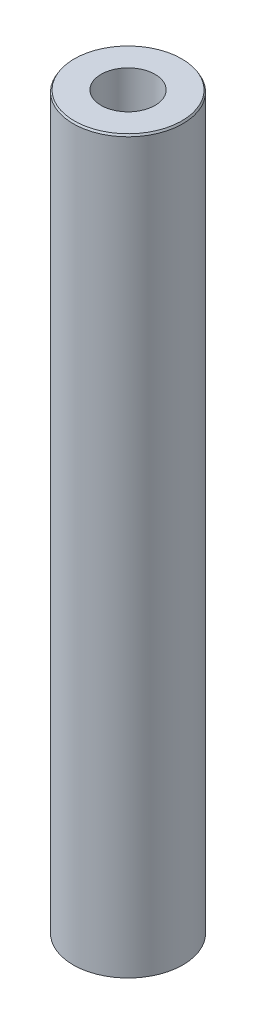
ISO-10303-21;
HEADER;
FILE_DESCRIPTION(('STEP AP214'),'2;1');
FILE_NAME('part.step','',(''),(''),'','','');
FILE_SCHEMA(('AUTOMOTIVE_DESIGN { 1 0 10303 214 1 1 1 1 }'));
ENDSEC;
DATA;
#1=APPLICATION_CONTEXT('core data for automotive mechanical design processes');
#2=APPLICATION_PROTOCOL_DEFINITION('international standard','automotive_design',2000,#1);
#3=PRODUCT_CONTEXT('',#1,'mechanical');
#4=PRODUCT('Part','Part','',(#3));
#5=PRODUCT_RELATED_PRODUCT_CATEGORY('part','',(#4));
#6=PRODUCT_DEFINITION_FORMATION('','',#4);
#7=PRODUCT_DEFINITION_CONTEXT('part definition',#1,'design');
#8=PRODUCT_DEFINITION('design','',#6,#7);
#9=PRODUCT_DEFINITION_SHAPE('','',#8);
#10=(LENGTH_UNIT() NAMED_UNIT(*) SI_UNIT(.MILLI.,.METRE.));
#11=(NAMED_UNIT(*) PLANE_ANGLE_UNIT() SI_UNIT($,.RADIAN.));
#12=(NAMED_UNIT(*) SI_UNIT($,.STERADIAN.) SOLID_ANGLE_UNIT());
#13=UNCERTAINTY_MEASURE_WITH_UNIT(LENGTH_MEASURE(1.E-05),#10,'distance_accuracy_value','');
#14=(GEOMETRIC_REPRESENTATION_CONTEXT(3) GLOBAL_UNCERTAINTY_ASSIGNED_CONTEXT((#13)) GLOBAL_UNIT_ASSIGNED_CONTEXT((#10,
#11,#12)) REPRESENTATION_CONTEXT('',''));
#15=CARTESIAN_POINT('',(0.,0.,0.));
#16=DIRECTION('',(0.,0.,1.));
#17=DIRECTION('',(1.,0.,0.));
#18=AXIS2_PLACEMENT_3D('',#15,#16,#17);
#19=CARTESIAN_POINT('',(0.,600.,0.));
#20=DIRECTION('',(0.,-1.,0.));
#21=DIRECTION('',(0.,0.,-1.));
#22=AXIS2_PLACEMENT_3D('',#19,#20,#21);
#23=CYLINDRICAL_SURFACE('',#22,45.);
#24=CARTESIAN_POINT('',(0.,598.449979658059,0.));
#25=DIRECTION('',(0.,1.,0.));
#26=DIRECTION('',(0.,0.,1.));
#27=AXIS2_PLACEMENT_3D('',#24,#25,#26);
#28=CIRCLE('',#27,45.);
#29=CARTESIAN_POINT('',(0.,598.449979658059,-45.));
#30=VERTEX_POINT('',#29);
#31=EDGE_CURVE('E50',#30,#30,#28,.F.);
#32=CARTESIAN_POINT('',(0.,0.894904661668861,0.));
#33=DIRECTION('',(0.,1.,0.));
#34=DIRECTION('',(0.,0.,1.));
#35=AXIS2_PLACEMENT_3D('',#32,#33,#34);
#36=CIRCLE('',#35,45.);
#37=CARTESIAN_POINT('',(0.,0.894904661668749,-45.));
#38=VERTEX_POINT('',#37);
#39=EDGE_CURVE('E51',#38,#38,#36,.T.);
#40=CARTESIAN_POINT('',(0.,598.449979658059,-45.));
#41=CARTESIAN_POINT('',(0.,592.225447626847,-45.));
#42=CARTESIAN_POINT('',(0.,586.000915595634,-45.));
#43=CARTESIAN_POINT('',(0.,573.551851533209,-45.));
#44=CARTESIAN_POINT('',(0.,567.327319501997,-45.));
#45=CARTESIAN_POINT('',(0.,554.878255439572,-45.));
#46=CARTESIAN_POINT('',(0.,548.65372340836,-45.));
#47=CARTESIAN_POINT('',(0.,536.204659345935,-45.));
#48=CARTESIAN_POINT('',(0.,529.980127314723,-45.));
#49=CARTESIAN_POINT('',(0.,517.531063252298,-45.));
#50=CARTESIAN_POINT('',(0.,511.306531221085,-45.));
#51=CARTESIAN_POINT('',(0.,498.857467158661,-45.));
#52=CARTESIAN_POINT('',(0.,492.632935127448,-45.));
#53=CARTESIAN_POINT('',(0.,480.183871065023,-45.));
#54=CARTESIAN_POINT('',(0.,473.959339033811,-45.));
#55=CARTESIAN_POINT('',(0.,461.510274971386,-45.));
#56=CARTESIAN_POINT('',(0.,455.285742940174,-45.));
#57=CARTESIAN_POINT('',(0.,442.836678877749,-45.));
#58=CARTESIAN_POINT('',(0.,436.612146846537,-45.));
#59=CARTESIAN_POINT('',(0.,424.163082784112,-45.));
#60=CARTESIAN_POINT('',(0.,417.938550752899,-45.));
#61=CARTESIAN_POINT('',(0.,405.489486690475,-45.));
#62=CARTESIAN_POINT('',(0.,399.264954659262,-45.));
#63=CARTESIAN_POINT('',(0.,386.815890596837,-45.));
#64=CARTESIAN_POINT('',(0.,380.591358565625,-45.));
#65=CARTESIAN_POINT('',(0.,368.1422945032,-45.));
#66=CARTESIAN_POINT('',(0.,361.917762471988,-45.));
#67=CARTESIAN_POINT('',(0.,349.468698409563,-45.));
#68=CARTESIAN_POINT('',(0.,343.244166378351,-45.));
#69=CARTESIAN_POINT('',(0.,330.795102315926,-45.));
#70=CARTESIAN_POINT('',(0.,324.570570284713,-45.));
#71=CARTESIAN_POINT('',(0.,312.121506222289,-45.));
#72=CARTESIAN_POINT('',(0.,305.896974191076,-45.));
#73=CARTESIAN_POINT('',(0.,293.447910128651,-45.));
#74=CARTESIAN_POINT('',(0.,287.223378097439,-45.));
#75=CARTESIAN_POINT('',(0.,274.774314035014,-45.));
#76=CARTESIAN_POINT('',(0.,268.549782003802,-45.));
#77=CARTESIAN_POINT('',(0.,256.100717941377,-45.));
#78=CARTESIAN_POINT('',(0.,249.876185910165,-45.));
#79=CARTESIAN_POINT('',(0.,237.42712184774,-45.));
#80=CARTESIAN_POINT('',(0.,231.202589816527,-45.));
#81=CARTESIAN_POINT('',(0.,218.753525754103,-45.));
#82=CARTESIAN_POINT('',(0.,212.52899372289,-45.));
#83=CARTESIAN_POINT('',(0.,200.079929660465,-45.));
#84=CARTESIAN_POINT('',(0.,193.855397629253,-45.));
#85=CARTESIAN_POINT('',(0.,181.406333566828,-45.));
#86=CARTESIAN_POINT('',(0.,175.181801535616,-45.));
#87=CARTESIAN_POINT('',(0.,162.732737473191,-45.));
#88=CARTESIAN_POINT('',(0.,156.508205441979,-45.));
#89=CARTESIAN_POINT('',(0.,144.059141379554,-45.));
#90=CARTESIAN_POINT('',(0.,137.834609348342,-45.));
#91=CARTESIAN_POINT('',(0.,125.385545285917,-45.));
#92=CARTESIAN_POINT('',(0.,119.161013254704,-45.));
#93=CARTESIAN_POINT('',(0.,106.711949192279,-45.));
#94=CARTESIAN_POINT('',(0.,100.487417161067,-45.));
#95=CARTESIAN_POINT('',(0.,88.0383530986423,-45.));
#96=CARTESIAN_POINT('',(0.,81.8138210674298,-45.));
#97=CARTESIAN_POINT('',(0.,69.3647570050051,-45.));
#98=CARTESIAN_POINT('',(0.,63.1402249737927,-45.));
#99=CARTESIAN_POINT('',(0.,50.6911609113679,-45.));
#100=CARTESIAN_POINT('',(0.,44.4666288801555,-45.));
#101=CARTESIAN_POINT('',(0.,32.0175648177307,-45.));
#102=CARTESIAN_POINT('',(0.,25.7930327865182,-45.));
#103=CARTESIAN_POINT('',(0.,13.3439687240935,-45.));
#104=CARTESIAN_POINT('',(0.,7.1194366928811,-45.));
#105=CARTESIAN_POINT('',(0.,0.894904661668749,-45.));
#106=B_SPLINE_CURVE_WITH_KNOTS('',3,(#40,#41,#42,#43,#44,#45,#46,#47,#48,#49,#50,#51,#52,#53,
#54,#55,#56,#57,#58,#59,#60,#61,#62,#63,#64,#65,#66,#67,#68,#69,#70,#71,#72,#73,#74,#75,#76,#77,
#78,#79,#80,#81,#82,#83,#84,#85,#86,#87,#88,#89,#90,#91,#92,#93,#94,#95,#96,#97,#98,#99,#100,
#101,#102,#103,#104,#105),.UNSPECIFIED.,.F.,.F.,(4,2,2,2,2,2,2,2,2,2,2,2,2,2,2,2,2,2,2,2,2,2,2,
2,2,2,2,2,2,2,2,2,4),(0.,18.6735960936372,37.3471921872743,56.0207882809115,74.6943843745487,
93.3679804681859,112.041576561823,130.71517265546,149.388768749098,168.062364842735,
186.735960936372,205.409557030009,224.083153123646,242.756749217284,261.430345310921,
280.103941404558,298.777537498195,317.451133591832,336.124729685469,354.798325779107,
373.471921872744,392.145517966381,410.819114060018,429.492710153655,448.166306247293,
466.83990234093,485.513498434567,504.187094528204,522.860690621842,541.534286715479,
560.207882809116,578.881478902753,597.55507499639),.UNSPECIFIED.);
#107=EDGE_CURVE('BSEAM39',#30,#38,#106,.T.);
#108=ORIENTED_EDGE('',*,*,#31,.T.);
#109=ORIENTED_EDGE('',*,*,#39,.T.);
#110=ORIENTED_EDGE('',*,*,#107,.T.);
#111=ORIENTED_EDGE('',*,*,#107,.F.);
#112=EDGE_LOOP('',(#108,#110,#109,#111));
#113=FACE_BOUND('',#112,.T.);
#114=ADVANCED_FACE('F39',(#113),#23,.T.);
#115=CARTESIAN_POINT('',(0.,600.,0.));
#116=DIRECTION('',(0.,1.,0.));
#117=DIRECTION('',(0.,0.,1.));
#118=AXIS2_PLACEMENT_3D('',#115,#116,#117);
#119=PLANE('',#118);
#120=CARTESIAN_POINT('',(0.,600.,0.));
#121=DIRECTION('',(0.,1.,0.));
#122=DIRECTION('',(0.,0.,1.));
#123=AXIS2_PLACEMENT_3D('',#120,#121,#122);
#124=CIRCLE('',#123,44.105095338331);
#125=CARTESIAN_POINT('',(0.,600.,-44.105095338331));
#126=VERTEX_POINT('',#125);
#127=EDGE_CURVE('E54',#126,#126,#124,.T.);
#128=ORIENTED_EDGE('',*,*,#127,.T.);
#129=EDGE_LOOP('',(#128));
#130=FACE_BOUND('',#129,.T.);
#131=CARTESIAN_POINT('',(0.,600.,0.));
#132=DIRECTION('',(0.,1.,0.));
#133=DIRECTION('',(0.,0.,1.));
#134=AXIS2_PLACEMENT_3D('',#131,#132,#133);
#135=CIRCLE('',#134,22.1217686309258);
#136=CARTESIAN_POINT('',(0.,600.,22.1217686309258));
#137=VERTEX_POINT('',#136);
#138=EDGE_CURVE('E58',#137,#137,#135,.T.);
#139=ORIENTED_EDGE('',*,*,#138,.F.);
#140=EDGE_LOOP('',(#139));
#141=FACE_BOUND('',#140,.T.);
#142=ADVANCED_FACE('F69',(#130,#141),#119,.T.);
#143=CARTESIAN_POINT('',(0.,0.,0.));
#144=DIRECTION('',(0.,1.,0.));
#145=DIRECTION('',(0.,0.,1.));
#146=AXIS2_PLACEMENT_3D('',#143,#144,#145);
#147=PLANE('',#146);
#148=CARTESIAN_POINT('',(0.,0.,0.));
#149=DIRECTION('',(0.,1.,0.));
#150=DIRECTION('',(0.,0.,1.));
#151=AXIS2_PLACEMENT_3D('',#148,#149,#150);
#152=CIRCLE('',#151,43.4499796580592);
#153=CARTESIAN_POINT('',(0.,0.,43.4499796580592));
#154=VERTEX_POINT('',#153);
#155=EDGE_CURVE('E10',#154,#154,#152,.F.);
#156=ORIENTED_EDGE('',*,*,#155,.T.);
#157=EDGE_LOOP('',(#156));
#158=FACE_BOUND('',#157,.T.);
#159=CARTESIAN_POINT('',(0.,0.,0.));
#160=DIRECTION('',(0.,1.,0.));
#161=DIRECTION('',(0.,0.,1.));
#162=AXIS2_PLACEMENT_3D('',#159,#160,#161);
#163=CIRCLE('',#162,22.1217686309258);
#164=CARTESIAN_POINT('',(0.,0.,22.1217686309258));
#165=VERTEX_POINT('',#164);
#166=EDGE_CURVE('E63',#165,#165,#163,.T.);
#167=ORIENTED_EDGE('',*,*,#166,.T.);
#168=EDGE_LOOP('',(#167));
#169=FACE_BOUND('',#168,.T.);
#170=ADVANCED_FACE('F75',(#158,#169),#147,.F.);
#171=CARTESIAN_POINT('',(0.,600.,0.));
#172=DIRECTION('',(0.,-1.,0.));
#173=DIRECTION('',(0.,0.,-1.));
#174=AXIS2_PLACEMENT_3D('',#171,#172,#173);
#175=CYLINDRICAL_SURFACE('',#174,22.1217686309258);
#176=ORIENTED_EDGE('',*,*,#138,.T.);
#177=EDGE_LOOP('',(#176));
#178=FACE_BOUND('',#177,.T.);
#179=ORIENTED_EDGE('',*,*,#166,.F.);
#180=EDGE_LOOP('',(#179));
#181=FACE_BOUND('',#180,.T.);
#182=ADVANCED_FACE('F70',(#178,#181),#175,.F.);
#183=CARTESIAN_POINT('',(0.,600.,0.));
#184=DIRECTION('',(0.,-1.,0.));
#185=DIRECTION('',(0.,0.,-1.));
#186=AXIS2_PLACEMENT_3D('',#183,#184,#185);
#187=CONICAL_SURFACE('',#186,44.105095338331,0.523598775598317);
#188=CARTESIAN_POINT('',(0.,598.449979658059,-45.));
#189=CARTESIAN_POINT('',(0.,598.466125703288,-44.990678076441));
#190=CARTESIAN_POINT('',(0.,598.482271748516,-44.9813561528819));
#191=CARTESIAN_POINT('',(0.,598.514563838973,-44.9627123057638));
#192=CARTESIAN_POINT('',(0.,598.530709884202,-44.9533903822048));
#193=CARTESIAN_POINT('',(0.,598.563001974659,-44.9347465350867));
#194=CARTESIAN_POINT('',(0.,598.579148019887,-44.9254246115276));
#195=CARTESIAN_POINT('',(0.,598.611440110344,-44.9067807644095));
#196=CARTESIAN_POINT('',(0.,598.627586155573,-44.8974588408505));
#197=CARTESIAN_POINT('',(0.,598.65987824603,-44.8788149937323));
#198=CARTESIAN_POINT('',(0.,598.676024291259,-44.8694930701733));
#199=CARTESIAN_POINT('',(0.,598.708316381716,-44.8508492230552));
#200=CARTESIAN_POINT('',(0.,598.724462426944,-44.8415272994961));
#201=CARTESIAN_POINT('',(0.,598.756754517402,-44.822883452378));
#202=CARTESIAN_POINT('',(0.,598.77290056263,-44.813561528819));
#203=CARTESIAN_POINT('',(0.,598.805192653087,-44.7949176817009));
#204=CARTESIAN_POINT('',(0.,598.821338698316,-44.7855957581418));
#205=CARTESIAN_POINT('',(0.,598.853630788773,-44.7669519110237));
#206=CARTESIAN_POINT('',(0.,598.869776834001,-44.7576299874647));
#207=CARTESIAN_POINT('',(0.,598.902068924458,-44.7389861403466));
#208=CARTESIAN_POINT('',(0.,598.918214969687,-44.7296642167875));
#209=CARTESIAN_POINT('',(0.,598.950507060144,-44.7110203696694));
#210=CARTESIAN_POINT('',(0.,598.966653105373,-44.7016984461104));
#211=CARTESIAN_POINT('',(0.,598.99894519583,-44.6830545989922));
#212=CARTESIAN_POINT('',(0.,599.015091241058,-44.6737326754332));
#213=CARTESIAN_POINT('',(0.,599.047383331515,-44.6550888283151));
#214=CARTESIAN_POINT('',(0.,599.063529376744,-44.645766904756));
#215=CARTESIAN_POINT('',(0.,599.095821467201,-44.6271230576379));
#216=CARTESIAN_POINT('',(0.,599.11196751243,-44.6178011340789));
#217=CARTESIAN_POINT('',(0.,599.144259602887,-44.5991572869608));
#218=CARTESIAN_POINT('',(0.,599.160405648115,-44.5898353634017));
#219=CARTESIAN_POINT('',(0.,599.192697738572,-44.5711915162836));
#220=CARTESIAN_POINT('',(0.,599.208843783801,-44.5618695927246));
#221=CARTESIAN_POINT('',(0.,599.241135874258,-44.5432257456065));
#222=CARTESIAN_POINT('',(0.,599.257281919487,-44.5339038220474));
#223=CARTESIAN_POINT('',(0.,599.289574009944,-44.5152599749293));
#224=CARTESIAN_POINT('',(0.,599.305720055172,-44.5059380513702));
#225=CARTESIAN_POINT('',(0.,599.338012145629,-44.4872942042521));
#226=CARTESIAN_POINT('',(0.,599.354158190858,-44.4779722806931));
#227=CARTESIAN_POINT('',(0.,599.386450281315,-44.459328433575));
#228=CARTESIAN_POINT('',(0.,599.402596326544,-44.4500065100159));
#229=CARTESIAN_POINT('',(0.,599.434888417001,-44.4313626628978));
#230=CARTESIAN_POINT('',(0.,599.451034462229,-44.4220407393388));
#231=CARTESIAN_POINT('',(0.,599.483326552686,-44.4033968922207));
#232=CARTESIAN_POINT('',(0.,599.499472597915,-44.3940749686616));
#233=CARTESIAN_POINT('',(0.,599.531764688372,-44.3754311215435));
#234=CARTESIAN_POINT('',(0.,599.5479107336,-44.3661091979845));
#235=CARTESIAN_POINT('',(0.,599.580202824058,-44.3474653508664));
#236=CARTESIAN_POINT('',(0.,599.596348869286,-44.3381434273073));
#237=CARTESIAN_POINT('',(0.,599.628640959743,-44.3194995801892));
#238=CARTESIAN_POINT('',(0.,599.644787004972,-44.3101776566301));
#239=CARTESIAN_POINT('',(0.,599.677079095429,-44.291533809512));
#240=CARTESIAN_POINT('',(0.,599.693225140657,-44.282211885953));
#241=CARTESIAN_POINT('',(0.,599.725517231115,-44.2635680388349));
#242=CARTESIAN_POINT('',(0.,599.741663276343,-44.2542461152758));
#243=CARTESIAN_POINT('',(0.,599.7739553668,-44.2356022681577));
#244=CARTESIAN_POINT('',(0.,599.790101412029,-44.2262803445987));
#245=CARTESIAN_POINT('',(0.,599.822393502486,-44.2076364974806));
#246=CARTESIAN_POINT('',(0.,599.838539547714,-44.1983145739215));
#247=CARTESIAN_POINT('',(0.,599.870831638172,-44.1796707268034));
#248=CARTESIAN_POINT('',(0.,599.8869776834,-44.1703488032444));
#249=CARTESIAN_POINT('',(0.,599.919269773857,-44.1517049561262));
#250=CARTESIAN_POINT('',(0.,599.935415819086,-44.1423830325672));
#251=CARTESIAN_POINT('',(0.,599.967707909543,-44.1237391854491));
#252=CARTESIAN_POINT('',(0.,599.983853954771,-44.11441726189));
#253=CARTESIAN_POINT('',(0.,600.,-44.105095338331));
#254=B_SPLINE_CURVE_WITH_KNOTS('',3,(#188,#189,#190,#191,#192,#193,#194,#195,#196,#197,#198,
#199,#200,#201,#202,#203,#204,#205,#206,#207,#208,#209,#210,#211,#212,#213,#214,#215,#216,#217,
#218,#219,#220,#221,#222,#223,#224,#225,#226,#227,#228,#229,#230,#231,#232,#233,#234,#235,#236,
#237,#238,#239,#240,#241,#242,#243,#244,#245,#246,#247,#248,#249,#250,#251,#252,#253),
.UNSPECIFIED.,.F.,.F.,(4,2,2,2,2,2,2,2,2,2,2,2,2,2,2,2,2,2,2,2,2,2,2,2,2,2,2,2,2,2,2,2,4),(0.,
0.0559315413542301,0.111863082708556,0.167794624062883,0.223726165417209,0.279657706771535,
0.335589248125858,0.391520789480184,0.44745233083451,0.50338387218874,0.559315413543067,
0.615246954897393,0.671178496251719,0.727110037606042,0.783041578960368,0.838973120314694,
0.89490466166902,0.950836203023251,1.00676774437758,1.0626992857319,1.11863082708623,
1.17456236844055,1.23049390979488,1.28642545114921,1.34235699250353,1.39828853385776,
1.45422007521208,1.51015161656641,1.56608315792074,1.62201469927506,1.67794624062939,
1.73387778198372,1.78980932333804),.UNSPECIFIED.);
#255=EDGE_CURVE('BSEAM81',#30,#126,#254,.T.);
#256=ORIENTED_EDGE('',*,*,#31,.F.);
#257=ORIENTED_EDGE('',*,*,#127,.F.);
#258=ORIENTED_EDGE('',*,*,#255,.T.);
#259=ORIENTED_EDGE('',*,*,#255,.F.);
#260=EDGE_LOOP('',(#256,#258,#257,#259));
#261=FACE_BOUND('',#260,.T.);
#262=ADVANCED_FACE('F81',(#261),#187,.T.);
#263=CARTESIAN_POINT('',(0.,0.894904661668861,0.));
#264=DIRECTION('',(0.,1.,0.));
#265=DIRECTION('',(0.,0.,1.));
#266=AXIS2_PLACEMENT_3D('',#263,#264,#265);
#267=CONICAL_SURFACE('',#266,45.,1.04719755119661);
#268=ORIENTED_EDGE('',*,*,#155,.F.);
#269=EDGE_LOOP('',(#268));
#270=FACE_BOUND('',#269,.T.);
#271=ORIENTED_EDGE('',*,*,#39,.F.);
#272=EDGE_LOOP('',(#271));
#273=FACE_BOUND('',#272,.T.);
#274=ADVANCED_FACE('F45',(#270,#273),#267,.T.);
#275=CLOSED_SHELL('',(#114,#142,#170,#182,#262,#274));
#276=MANIFOLD_SOLID_BREP('B2',#275);
#277=ADVANCED_BREP_SHAPE_REPRESENTATION('',(#18,#276),#14);
#278=SHAPE_DEFINITION_REPRESENTATION(#9,#277);
ENDSEC;
END-ISO-10303-21;
